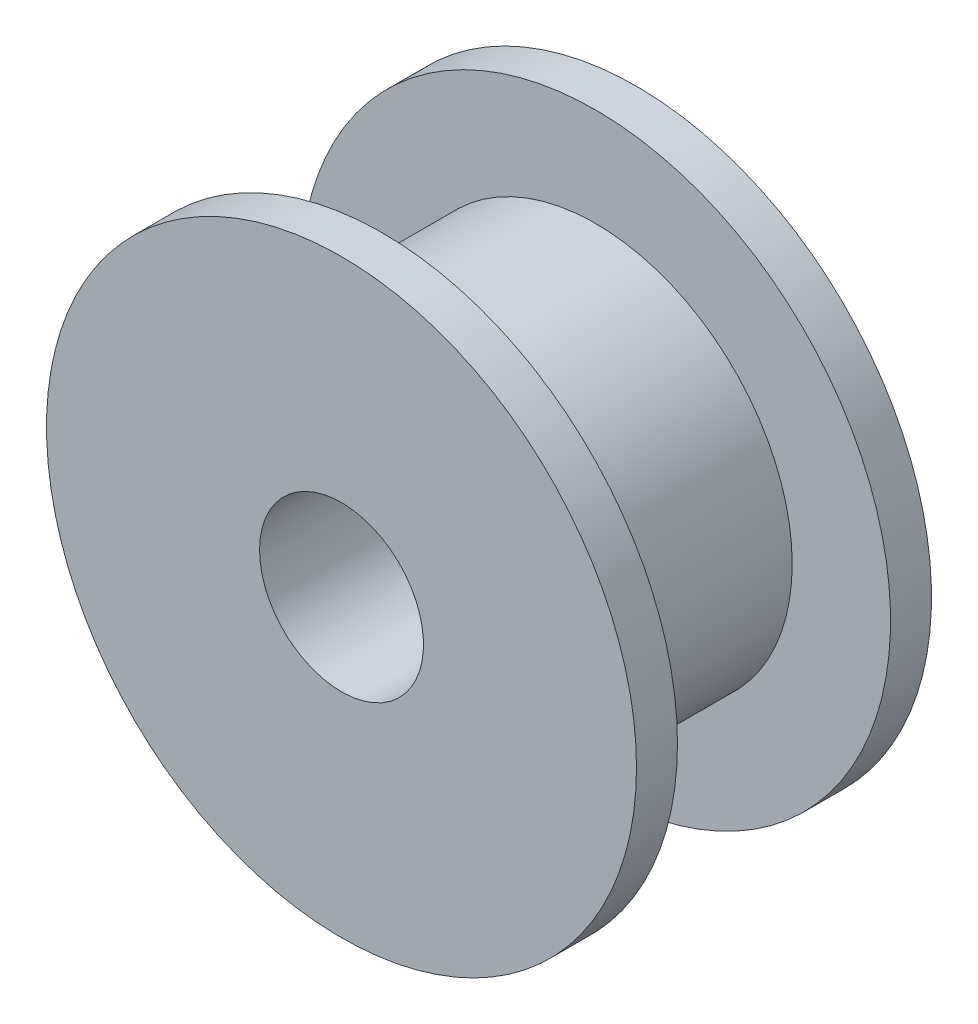
ISO-10303-21;
HEADER;
FILE_DESCRIPTION(('STEP AP214'),'2;1');
FILE_NAME('part.step','',(''),(''),'','','');
FILE_SCHEMA(('AUTOMOTIVE_DESIGN { 1 0 10303 214 1 1 1 1 }'));
ENDSEC;
DATA;
#1=APPLICATION_CONTEXT('core data for automotive mechanical design processes');
#2=APPLICATION_PROTOCOL_DEFINITION('international standard','automotive_design',2000,#1);
#3=PRODUCT_CONTEXT('',#1,'mechanical');
#4=PRODUCT('Part','Part','',(#3));
#5=PRODUCT_RELATED_PRODUCT_CATEGORY('part','',(#4));
#6=PRODUCT_DEFINITION_FORMATION('','',#4);
#7=PRODUCT_DEFINITION_CONTEXT('part definition',#1,'design');
#8=PRODUCT_DEFINITION('design','',#6,#7);
#9=PRODUCT_DEFINITION_SHAPE('','',#8);
#10=(LENGTH_UNIT() NAMED_UNIT(*) SI_UNIT(.MILLI.,.METRE.));
#11=(NAMED_UNIT(*) PLANE_ANGLE_UNIT() SI_UNIT($,.RADIAN.));
#12=(NAMED_UNIT(*) SI_UNIT($,.STERADIAN.) SOLID_ANGLE_UNIT());
#13=UNCERTAINTY_MEASURE_WITH_UNIT(LENGTH_MEASURE(1.E-05),#10,'distance_accuracy_value','');
#14=(GEOMETRIC_REPRESENTATION_CONTEXT(3) GLOBAL_UNCERTAINTY_ASSIGNED_CONTEXT((#13)) GLOBAL_UNIT_ASSIGNED_CONTEXT((#10,
#11,#12)) REPRESENTATION_CONTEXT('',''));
#15=CARTESIAN_POINT('',(0.,0.,0.));
#16=DIRECTION('',(0.,0.,1.));
#17=DIRECTION('',(1.,0.,0.));
#18=AXIS2_PLACEMENT_3D('',#15,#16,#17);
#19=CARTESIAN_POINT('',(0.,0.,6.5));
#20=DIRECTION('',(0.,0.,-1.));
#21=DIRECTION('',(-1.,0.,0.));
#22=AXIS2_PLACEMENT_3D('',#19,#20,#21);
#23=CYLINDRICAL_SURFACE('',#22,6.);
#24=CARTESIAN_POINT('',(0.,0.,6.5));
#25=DIRECTION('',(0.,0.,1.));
#26=DIRECTION('',(1.,0.,0.));
#27=AXIS2_PLACEMENT_3D('',#24,#25,#26);
#28=CIRCLE('',#27,6.);
#29=CARTESIAN_POINT('',(6.,0.,6.5));
#30=VERTEX_POINT('',#29);
#31=EDGE_CURVE('E10',#30,#30,#28,.T.);
#32=ORIENTED_EDGE('',*,*,#31,.F.);
#33=EDGE_LOOP('',(#32));
#34=FACE_BOUND('',#33,.T.);
#35=CARTESIAN_POINT('',(0.,0.,0.));
#36=DIRECTION('',(0.,0.,1.));
#37=DIRECTION('',(1.,0.,0.));
#38=AXIS2_PLACEMENT_3D('',#35,#36,#37);
#39=CIRCLE('',#38,6.);
#40=CARTESIAN_POINT('',(6.,0.,0.));
#41=VERTEX_POINT('',#40);
#42=EDGE_CURVE('E35',#41,#41,#39,.T.);
#43=ORIENTED_EDGE('',*,*,#42,.T.);
#44=EDGE_LOOP('',(#43));
#45=FACE_BOUND('',#44,.T.);
#46=ADVANCED_FACE('F32',(#34,#45),#23,.T.);
#47=CARTESIAN_POINT('',(0.,0.,7.75));
#48=DIRECTION('',(0.,0.,-1.));
#49=DIRECTION('',(-1.,0.,0.));
#50=AXIS2_PLACEMENT_3D('',#47,#48,#49);
#51=CYLINDRICAL_SURFACE('',#50,9.);
#52=CARTESIAN_POINT('',(0.,0.,7.75));
#53=DIRECTION('',(0.,0.,1.));
#54=DIRECTION('',(1.,0.,0.));
#55=AXIS2_PLACEMENT_3D('',#52,#53,#54);
#56=CIRCLE('',#55,9.);
#57=CARTESIAN_POINT('',(9.,0.,7.75));
#58=VERTEX_POINT('',#57);
#59=EDGE_CURVE('E39',#58,#58,#56,.T.);
#60=ORIENTED_EDGE('',*,*,#59,.F.);
#61=EDGE_LOOP('',(#60));
#62=FACE_BOUND('',#61,.T.);
#63=CARTESIAN_POINT('',(0.,0.,6.5));
#64=DIRECTION('',(0.,0.,1.));
#65=DIRECTION('',(1.,0.,0.));
#66=AXIS2_PLACEMENT_3D('',#63,#64,#65);
#67=CIRCLE('',#66,9.);
#68=CARTESIAN_POINT('',(9.,0.,6.5));
#69=VERTEX_POINT('',#68);
#70=EDGE_CURVE('E43',#69,#69,#67,.T.);
#71=ORIENTED_EDGE('',*,*,#70,.T.);
#72=EDGE_LOOP('',(#71));
#73=FACE_BOUND('',#72,.T.);
#74=ADVANCED_FACE('F91',(#62,#73),#51,.T.);
#75=CARTESIAN_POINT('',(0.,0.,7.75));
#76=DIRECTION('',(0.,0.,1.));
#77=DIRECTION('',(1.,0.,0.));
#78=AXIS2_PLACEMENT_3D('',#75,#76,#77);
#79=PLANE('',#78);
#80=CARTESIAN_POINT('',(0.,0.,7.75));
#81=DIRECTION('',(0.,0.,-1.));
#82=DIRECTION('',(-1.,0.,0.));
#83=AXIS2_PLACEMENT_3D('',#80,#81,#82);
#84=CIRCLE('',#83,2.5);
#85=CARTESIAN_POINT('',(-2.5,0.,7.75));
#86=VERTEX_POINT('',#85);
#87=EDGE_CURVE('E52',#86,#86,#84,.T.);
#88=ORIENTED_EDGE('',*,*,#87,.T.);
#89=EDGE_LOOP('',(#88));
#90=FACE_BOUND('',#89,.T.);
#91=ORIENTED_EDGE('',*,*,#59,.T.);
#92=EDGE_LOOP('',(#91));
#93=FACE_BOUND('',#92,.T.);
#94=ADVANCED_FACE('F61',(#90,#93),#79,.T.);
#95=CARTESIAN_POINT('',(0.,0.,6.5));
#96=DIRECTION('',(0.,0.,1.));
#97=DIRECTION('',(1.,0.,0.));
#98=AXIS2_PLACEMENT_3D('',#95,#96,#97);
#99=PLANE('',#98);
#100=ORIENTED_EDGE('',*,*,#31,.T.);
#101=EDGE_LOOP('',(#100));
#102=FACE_BOUND('',#101,.T.);
#103=ORIENTED_EDGE('',*,*,#70,.F.);
#104=EDGE_LOOP('',(#103));
#105=FACE_BOUND('',#104,.T.);
#106=ADVANCED_FACE('F80',(#102,#105),#99,.F.);
#107=CARTESIAN_POINT('',(0.,0.,-1.25));
#108=DIRECTION('',(0.,0.,1.));
#109=DIRECTION('',(1.,0.,0.));
#110=AXIS2_PLACEMENT_3D('',#107,#108,#109);
#111=CYLINDRICAL_SURFACE('',#110,9.);
#112=CARTESIAN_POINT('',(0.,0.,-1.25));
#113=DIRECTION('',(0.,0.,-1.));
#114=DIRECTION('',(-1.,0.,0.));
#115=AXIS2_PLACEMENT_3D('',#112,#113,#114);
#116=CIRCLE('',#115,9.);
#117=CARTESIAN_POINT('',(-9.,0.,-1.25));
#118=VERTEX_POINT('',#117);
#119=EDGE_CURVE('E51',#118,#118,#116,.T.);
#120=ORIENTED_EDGE('',*,*,#119,.F.);
#121=EDGE_LOOP('',(#120));
#122=FACE_BOUND('',#121,.T.);
#123=CARTESIAN_POINT('',(0.,0.,0.));
#124=DIRECTION('',(0.,0.,-1.));
#125=DIRECTION('',(-1.,0.,0.));
#126=AXIS2_PLACEMENT_3D('',#123,#124,#125);
#127=CIRCLE('',#126,9.);
#128=CARTESIAN_POINT('',(-9.,0.,0.));
#129=VERTEX_POINT('',#128);
#130=EDGE_CURVE('E48',#129,#129,#127,.T.);
#131=ORIENTED_EDGE('',*,*,#130,.T.);
#132=EDGE_LOOP('',(#131));
#133=FACE_BOUND('',#132,.T.);
#134=ADVANCED_FACE('F74',(#122,#133),#111,.T.);
#135=CARTESIAN_POINT('',(0.,0.,-1.25));
#136=DIRECTION('',(0.,0.,-1.));
#137=DIRECTION('',(-1.,0.,0.));
#138=AXIS2_PLACEMENT_3D('',#135,#136,#137);
#139=PLANE('',#138);
#140=CARTESIAN_POINT('',(0.,0.,-1.25));
#141=DIRECTION('',(0.,0.,-1.));
#142=DIRECTION('',(-1.,0.,0.));
#143=AXIS2_PLACEMENT_3D('',#140,#141,#142);
#144=CIRCLE('',#143,2.5);
#145=CARTESIAN_POINT('',(-2.5,0.,-1.25));
#146=VERTEX_POINT('',#145);
#147=EDGE_CURVE('E55',#146,#146,#144,.T.);
#148=ORIENTED_EDGE('',*,*,#147,.F.);
#149=EDGE_LOOP('',(#148));
#150=FACE_BOUND('',#149,.T.);
#151=ORIENTED_EDGE('',*,*,#119,.T.);
#152=EDGE_LOOP('',(#151));
#153=FACE_BOUND('',#152,.T.);
#154=ADVANCED_FACE('F71',(#150,#153),#139,.T.);
#155=CARTESIAN_POINT('',(0.,0.,0.));
#156=DIRECTION('',(0.,0.,-1.));
#157=DIRECTION('',(-1.,0.,0.));
#158=AXIS2_PLACEMENT_3D('',#155,#156,#157);
#159=PLANE('',#158);
#160=ORIENTED_EDGE('',*,*,#42,.F.);
#161=EDGE_LOOP('',(#160));
#162=FACE_BOUND('',#161,.T.);
#163=ORIENTED_EDGE('',*,*,#130,.F.);
#164=EDGE_LOOP('',(#163));
#165=FACE_BOUND('',#164,.T.);
#166=ADVANCED_FACE('F67',(#162,#165),#159,.F.);
#167=CARTESIAN_POINT('',(0.,0.,7.75));
#168=DIRECTION('',(0.,0.,-1.));
#169=DIRECTION('',(-1.,0.,0.));
#170=AXIS2_PLACEMENT_3D('',#167,#168,#169);
#171=CYLINDRICAL_SURFACE('',#170,2.5);
#172=ORIENTED_EDGE('',*,*,#87,.F.);
#173=EDGE_LOOP('',(#172));
#174=FACE_BOUND('',#173,.T.);
#175=ORIENTED_EDGE('',*,*,#147,.T.);
#176=EDGE_LOOP('',(#175));
#177=FACE_BOUND('',#176,.T.);
#178=ADVANCED_FACE('F64',(#174,#177),#171,.F.);
#179=CLOSED_SHELL('',(#46,#74,#94,#106,#134,#154,#166,#178));
#180=MANIFOLD_SOLID_BREP('B2',#179);
#181=ADVANCED_BREP_SHAPE_REPRESENTATION('',(#18,#180),#14);
#182=SHAPE_DEFINITION_REPRESENTATION(#9,#181);
ENDSEC;
END-ISO-10303-21;
